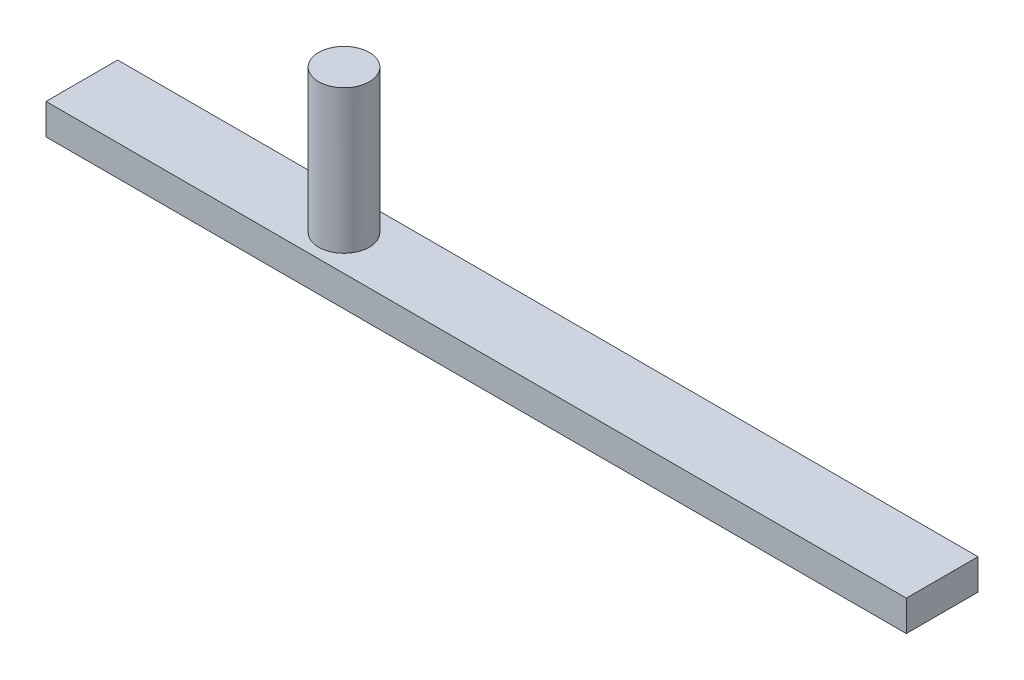
ISO-10303-21;
HEADER;
FILE_DESCRIPTION(('STEP AP214'),'2;1');
FILE_NAME('part.step','',(''),(''),'','','');
FILE_SCHEMA(('AUTOMOTIVE_DESIGN { 1 0 10303 214 1 1 1 1 }'));
ENDSEC;
DATA;
#1=APPLICATION_CONTEXT('core data for automotive mechanical design processes');
#2=APPLICATION_PROTOCOL_DEFINITION('international standard','automotive_design',2000,#1);
#3=PRODUCT_CONTEXT('',#1,'mechanical');
#4=PRODUCT('Part','Part','',(#3));
#5=PRODUCT_RELATED_PRODUCT_CATEGORY('part','',(#4));
#6=PRODUCT_DEFINITION_FORMATION('','',#4);
#7=PRODUCT_DEFINITION_CONTEXT('part definition',#1,'design');
#8=PRODUCT_DEFINITION('design','',#6,#7);
#9=PRODUCT_DEFINITION_SHAPE('','',#8);
#10=(LENGTH_UNIT() NAMED_UNIT(*) SI_UNIT(.MILLI.,.METRE.));
#11=(NAMED_UNIT(*) PLANE_ANGLE_UNIT() SI_UNIT($,.RADIAN.));
#12=(NAMED_UNIT(*) SI_UNIT($,.STERADIAN.) SOLID_ANGLE_UNIT());
#13=UNCERTAINTY_MEASURE_WITH_UNIT(LENGTH_MEASURE(1.E-05),#10,'distance_accuracy_value','');
#14=(GEOMETRIC_REPRESENTATION_CONTEXT(3) GLOBAL_UNCERTAINTY_ASSIGNED_CONTEXT((#13)) GLOBAL_UNIT_ASSIGNED_CONTEXT((#10,
#11,#12)) REPRESENTATION_CONTEXT('',''));
#15=CARTESIAN_POINT('',(0.,0.,0.));
#16=DIRECTION('',(0.,0.,1.));
#17=DIRECTION('',(1.,0.,0.));
#18=AXIS2_PLACEMENT_3D('',#15,#16,#17);
#19=CARTESIAN_POINT('',(0.,38.1,0.));
#20=DIRECTION('',(1.,0.,0.));
#21=DIRECTION('',(0.,0.,-1.));
#22=AXIS2_PLACEMENT_3D('',#19,#20,#21);
#23=PLANE('',#22);
#24=DIRECTION('',(0.,0.,1.));
#25=VECTOR('',#24,1.);
#26=CARTESIAN_POINT('',(0.,0.,0.));
#27=LINE('',#26,#25);
#28=CARTESIAN_POINT('',(0.,0.,-88.9));
#29=VERTEX_POINT('',#28);
#30=CARTESIAN_POINT('',(0.,0.,0.));
#31=VERTEX_POINT('',#30);
#32=EDGE_CURVE('E105',#29,#31,#27,.T.);
#33=ORIENTED_EDGE('',*,*,#32,.T.);
#34=DIRECTION('',(0.,-1.,0.));
#35=VECTOR('',#34,1.);
#36=CARTESIAN_POINT('',(0.,38.1,0.));
#37=LINE('',#36,#35);
#38=CARTESIAN_POINT('',(0.,38.1,0.));
#39=VERTEX_POINT('',#38);
#40=EDGE_CURVE('E47',#39,#31,#37,.T.);
#41=ORIENTED_EDGE('',*,*,#40,.F.);
#42=DIRECTION('',(0.,0.,1.));
#43=VECTOR('',#42,1.);
#44=CARTESIAN_POINT('',(0.,38.1,0.));
#45=LINE('',#44,#43);
#46=CARTESIAN_POINT('',(0.,38.1,-88.9));
#47=VERTEX_POINT('',#46);
#48=EDGE_CURVE('E91',#47,#39,#45,.T.);
#49=ORIENTED_EDGE('',*,*,#48,.F.);
#50=DIRECTION('',(0.,-1.,0.));
#51=VECTOR('',#50,1.);
#52=CARTESIAN_POINT('',(0.,38.1,-88.9));
#53=LINE('',#52,#51);
#54=EDGE_CURVE('E101',#47,#29,#53,.T.);
#55=ORIENTED_EDGE('',*,*,#54,.T.);
#56=EDGE_LOOP('',(#33,#41,#49,#55));
#57=FACE_BOUND('',#56,.T.);
#58=ADVANCED_FACE('F39',(#57),#23,.F.);
#59=CARTESIAN_POINT('',(0.,38.1,0.));
#60=DIRECTION('',(0.,0.,-1.));
#61=DIRECTION('',(-1.,0.,0.));
#62=AXIS2_PLACEMENT_3D('',#59,#60,#61);
#63=PLANE('',#62);
#64=DIRECTION('',(1.,0.,0.));
#65=VECTOR('',#64,1.);
#66=CARTESIAN_POINT('',(0.,0.,0.));
#67=LINE('',#66,#65);
#68=CARTESIAN_POINT('',(1066.8,0.,0.));
#69=VERTEX_POINT('',#68);
#70=EDGE_CURVE('E96',#31,#69,#67,.T.);
#71=ORIENTED_EDGE('',*,*,#70,.T.);
#72=DIRECTION('',(0.,-1.,0.));
#73=VECTOR('',#72,1.);
#74=CARTESIAN_POINT('',(1066.8,38.1,0.));
#75=LINE('',#74,#73);
#76=CARTESIAN_POINT('',(1066.8,38.1,0.));
#77=VERTEX_POINT('',#76);
#78=EDGE_CURVE('E94',#77,#69,#75,.T.);
#79=ORIENTED_EDGE('',*,*,#78,.F.);
#80=DIRECTION('',(1.,0.,0.));
#81=VECTOR('',#80,1.);
#82=CARTESIAN_POINT('',(0.,38.1,0.));
#83=LINE('',#82,#81);
#84=EDGE_CURVE('E86',#39,#77,#83,.T.);
#85=ORIENTED_EDGE('',*,*,#84,.F.);
#86=ORIENTED_EDGE('',*,*,#40,.T.);
#87=EDGE_LOOP('',(#71,#79,#85,#86));
#88=FACE_BOUND('',#87,.T.);
#89=ADVANCED_FACE('F95',(#88),#63,.F.);
#90=CARTESIAN_POINT('',(1066.8,38.1,0.));
#91=DIRECTION('',(-1.,0.,0.));
#92=DIRECTION('',(0.,0.,1.));
#93=AXIS2_PLACEMENT_3D('',#90,#91,#92);
#94=PLANE('',#93);
#95=DIRECTION('',(0.,0.,-1.));
#96=VECTOR('',#95,1.);
#97=CARTESIAN_POINT('',(1066.8,0.,0.));
#98=LINE('',#97,#96);
#99=CARTESIAN_POINT('',(1066.8,0.,-88.9));
#100=VERTEX_POINT('',#99);
#101=EDGE_CURVE('E72',#69,#100,#98,.T.);
#102=ORIENTED_EDGE('',*,*,#101,.T.);
#103=DIRECTION('',(0.,-1.,0.));
#104=VECTOR('',#103,1.);
#105=CARTESIAN_POINT('',(1066.8,38.1,-88.9));
#106=LINE('',#105,#104);
#107=CARTESIAN_POINT('',(1066.8,38.1,-88.9));
#108=VERTEX_POINT('',#107);
#109=EDGE_CURVE('E97',#108,#100,#106,.T.);
#110=ORIENTED_EDGE('',*,*,#109,.F.);
#111=DIRECTION('',(0.,0.,-1.));
#112=VECTOR('',#111,1.);
#113=CARTESIAN_POINT('',(1066.8,38.1,0.));
#114=LINE('',#113,#112);
#115=EDGE_CURVE('E89',#77,#108,#114,.T.);
#116=ORIENTED_EDGE('',*,*,#115,.F.);
#117=ORIENTED_EDGE('',*,*,#78,.T.);
#118=EDGE_LOOP('',(#102,#110,#116,#117));
#119=FACE_BOUND('',#118,.T.);
#120=ADVANCED_FACE('F99',(#119),#94,.F.);
#121=CARTESIAN_POINT('',(0.,38.1,-88.9));
#122=DIRECTION('',(0.,0.,1.));
#123=DIRECTION('',(1.,0.,0.));
#124=AXIS2_PLACEMENT_3D('',#121,#122,#123);
#125=PLANE('',#124);
#126=DIRECTION('',(-1.,0.,0.));
#127=VECTOR('',#126,1.);
#128=CARTESIAN_POINT('',(0.,0.,-88.9));
#129=LINE('',#128,#127);
#130=EDGE_CURVE('E78',#100,#29,#129,.T.);
#131=ORIENTED_EDGE('',*,*,#130,.T.);
#132=ORIENTED_EDGE('',*,*,#54,.F.);
#133=DIRECTION('',(-1.,0.,0.));
#134=VECTOR('',#133,1.);
#135=CARTESIAN_POINT('',(0.,38.1,-88.9));
#136=LINE('',#135,#134);
#137=EDGE_CURVE('E55',#108,#47,#136,.T.);
#138=ORIENTED_EDGE('',*,*,#137,.F.);
#139=ORIENTED_EDGE('',*,*,#109,.T.);
#140=EDGE_LOOP('',(#131,#132,#138,#139));
#141=FACE_BOUND('',#140,.T.);
#142=ADVANCED_FACE('F128',(#141),#125,.F.);
#143=CARTESIAN_POINT('',(0.,38.1,0.));
#144=DIRECTION('',(0.,-1.,0.));
#145=DIRECTION('',(0.,0.,-1.));
#146=AXIS2_PLACEMENT_3D('',#143,#144,#145);
#147=PLANE('',#146);
#148=CARTESIAN_POINT('',(325.671457388567,38.1,-43.8547892761851));
#149=DIRECTION('',(0.,-1.,0.));
#150=DIRECTION('',(0.,0.,-1.));
#151=AXIS2_PLACEMENT_3D('',#148,#149,#150);
#152=CIRCLE('',#151,31.4280280389225);
#153=CARTESIAN_POINT('',(325.671457388567,38.1,-75.2828173151076));
#154=VERTEX_POINT('',#153);
#155=EDGE_CURVE('E11',#154,#154,#152,.F.);
#156=ORIENTED_EDGE('',*,*,#155,.F.);
#157=EDGE_LOOP('',(#156));
#158=FACE_BOUND('',#157,.T.);
#159=ORIENTED_EDGE('',*,*,#48,.T.);
#160=ORIENTED_EDGE('',*,*,#84,.T.);
#161=ORIENTED_EDGE('',*,*,#115,.T.);
#162=ORIENTED_EDGE('',*,*,#137,.T.);
#163=EDGE_LOOP('',(#159,#160,#161,#162));
#164=FACE_BOUND('',#163,.T.);
#165=ADVANCED_FACE('F87',(#158,#164),#147,.F.);
#166=CARTESIAN_POINT('',(0.,0.,0.));
#167=DIRECTION('',(0.,-1.,0.));
#168=DIRECTION('',(0.,0.,-1.));
#169=AXIS2_PLACEMENT_3D('',#166,#167,#168);
#170=PLANE('',#169);
#171=ORIENTED_EDGE('',*,*,#32,.F.);
#172=ORIENTED_EDGE('',*,*,#130,.F.);
#173=ORIENTED_EDGE('',*,*,#101,.F.);
#174=ORIENTED_EDGE('',*,*,#70,.F.);
#175=EDGE_LOOP('',(#171,#172,#173,#174));
#176=FACE_BOUND('',#175,.T.);
#177=ADVANCED_FACE('F116',(#176),#170,.T.);
#178=CARTESIAN_POINT('',(325.671457388567,215.9,-43.8547892761851));
#179=DIRECTION('',(0.,-1.,0.));
#180=DIRECTION('',(0.,0.,-1.));
#181=AXIS2_PLACEMENT_3D('',#178,#179,#180);
#182=CYLINDRICAL_SURFACE('',#181,31.4280280389225);
#183=CARTESIAN_POINT('',(325.671457388567,215.9,-43.8547892761851));
#184=DIRECTION('',(0.,1.,0.));
#185=DIRECTION('',(0.,0.,1.));
#186=AXIS2_PLACEMENT_3D('',#183,#184,#185);
#187=CIRCLE('',#186,31.4280280389225);
#188=CARTESIAN_POINT('',(325.671457388567,215.9,-12.4267612372626));
#189=VERTEX_POINT('',#188);
#190=EDGE_CURVE('E108',#189,#189,#187,.T.);
#191=ORIENTED_EDGE('',*,*,#190,.F.);
#192=EDGE_LOOP('',(#191));
#193=FACE_BOUND('',#192,.T.);
#194=ORIENTED_EDGE('',*,*,#155,.T.);
#195=EDGE_LOOP('',(#194));
#196=FACE_BOUND('',#195,.T.);
#197=ADVANCED_FACE('F118',(#193,#196),#182,.T.);
#198=CARTESIAN_POINT('',(325.671457388567,215.9,-43.8547892761851));
#199=DIRECTION('',(0.,1.,0.));
#200=DIRECTION('',(0.,0.,1.));
#201=AXIS2_PLACEMENT_3D('',#198,#199,#200);
#202=PLANE('',#201);
#203=ORIENTED_EDGE('',*,*,#190,.T.);
#204=EDGE_LOOP('',(#203));
#205=FACE_BOUND('',#204,.T.);
#206=ADVANCED_FACE('F125',(#205),#202,.T.);
#207=CLOSED_SHELL('',(#58,#89,#120,#142,#165,#177,#197,#206));
#208=MANIFOLD_SOLID_BREP('B2',#207);
#209=ADVANCED_BREP_SHAPE_REPRESENTATION('',(#18,#208),#14);
#210=SHAPE_DEFINITION_REPRESENTATION(#9,#209);
ENDSEC;
END-ISO-10303-21;
